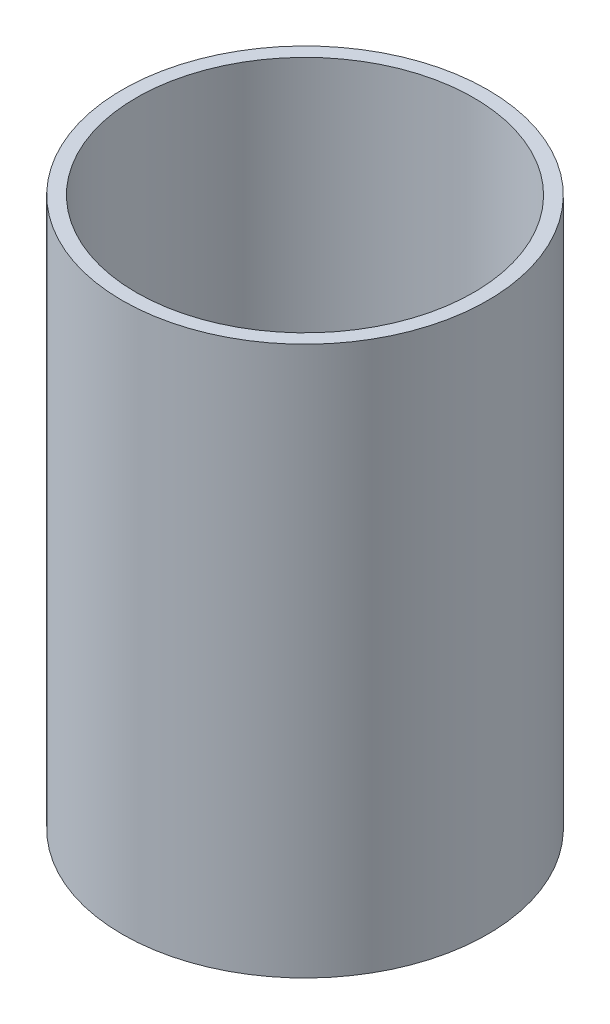
ISO-10303-21;
HEADER;
FILE_DESCRIPTION(('STEP AP214'),'2;1');
FILE_NAME('part.step','',(''),(''),'','','');
FILE_SCHEMA(('AUTOMOTIVE_DESIGN { 1 0 10303 214 1 1 1 1 }'));
ENDSEC;
DATA;
#1=APPLICATION_CONTEXT('core data for automotive mechanical design processes');
#2=APPLICATION_PROTOCOL_DEFINITION('international standard','automotive_design',2000,#1);
#3=PRODUCT_CONTEXT('',#1,'mechanical');
#4=PRODUCT('Part','Part','',(#3));
#5=PRODUCT_RELATED_PRODUCT_CATEGORY('part','',(#4));
#6=PRODUCT_DEFINITION_FORMATION('','',#4);
#7=PRODUCT_DEFINITION_CONTEXT('part definition',#1,'design');
#8=PRODUCT_DEFINITION('design','',#6,#7);
#9=PRODUCT_DEFINITION_SHAPE('','',#8);
#10=(LENGTH_UNIT() NAMED_UNIT(*) SI_UNIT(.MILLI.,.METRE.));
#11=(NAMED_UNIT(*) PLANE_ANGLE_UNIT() SI_UNIT($,.RADIAN.));
#12=(NAMED_UNIT(*) SI_UNIT($,.STERADIAN.) SOLID_ANGLE_UNIT());
#13=UNCERTAINTY_MEASURE_WITH_UNIT(LENGTH_MEASURE(1.E-05),#10,'distance_accuracy_value','');
#14=(GEOMETRIC_REPRESENTATION_CONTEXT(3) GLOBAL_UNCERTAINTY_ASSIGNED_CONTEXT((#13)) GLOBAL_UNIT_ASSIGNED_CONTEXT((#10,
#11,#12)) REPRESENTATION_CONTEXT('',''));
#15=CARTESIAN_POINT('',(0.,0.,0.));
#16=DIRECTION('',(0.,0.,1.));
#17=DIRECTION('',(1.,0.,0.));
#18=AXIS2_PLACEMENT_3D('',#15,#16,#17);
#19=CARTESIAN_POINT('',(0.,0.,0.));
#20=DIRECTION('',(0.,1.,0.));
#21=DIRECTION('',(0.,0.,1.));
#22=AXIS2_PLACEMENT_3D('',#19,#20,#21);
#23=CYLINDRICAL_SURFACE('',#22,9.525);
#24=CARTESIAN_POINT('',(0.,0.,0.));
#25=DIRECTION('',(0.,1.,0.));
#26=DIRECTION('',(0.,0.,1.));
#27=AXIS2_PLACEMENT_3D('',#24,#25,#26);
#28=CIRCLE('',#27,9.525);
#29=CARTESIAN_POINT('',(0.,0.,9.525));
#30=VERTEX_POINT('',#29);
#31=EDGE_CURVE('E10',#30,#30,#28,.T.);
#32=ORIENTED_EDGE('',*,*,#31,.F.);
#33=EDGE_LOOP('',(#32));
#34=FACE_BOUND('',#33,.T.);
#35=CARTESIAN_POINT('',(0.,30.988,0.));
#36=DIRECTION('',(0.,1.,0.));
#37=DIRECTION('',(0.,0.,1.));
#38=AXIS2_PLACEMENT_3D('',#35,#36,#37);
#39=CIRCLE('',#38,9.525);
#40=CARTESIAN_POINT('',(0.,30.988,9.525));
#41=VERTEX_POINT('',#40);
#42=EDGE_CURVE('E46',#41,#41,#39,.T.);
#43=ORIENTED_EDGE('',*,*,#42,.T.);
#44=EDGE_LOOP('',(#43));
#45=FACE_BOUND('',#44,.T.);
#46=ADVANCED_FACE('F32',(#34,#45),#23,.F.);
#47=CARTESIAN_POINT('',(9.525,0.,0.));
#48=DIRECTION('',(0.,1.,0.));
#49=DIRECTION('',(0.,0.,1.));
#50=AXIS2_PLACEMENT_3D('',#47,#48,#49);
#51=PLANE('',#50);
#52=CARTESIAN_POINT('',(0.,0.,0.));
#53=DIRECTION('',(0.,1.,0.));
#54=DIRECTION('',(0.,0.,1.));
#55=AXIS2_PLACEMENT_3D('',#52,#53,#54);
#56=CIRCLE('',#55,10.3124);
#57=CARTESIAN_POINT('',(0.,0.,10.3124));
#58=VERTEX_POINT('',#57);
#59=EDGE_CURVE('E38',#58,#58,#56,.T.);
#60=ORIENTED_EDGE('',*,*,#59,.F.);
#61=EDGE_LOOP('',(#60));
#62=FACE_BOUND('',#61,.T.);
#63=ORIENTED_EDGE('',*,*,#31,.T.);
#64=EDGE_LOOP('',(#63));
#65=FACE_BOUND('',#64,.T.);
#66=ADVANCED_FACE('F61',(#62,#65),#51,.F.);
#67=CARTESIAN_POINT('',(0.,0.,0.));
#68=DIRECTION('',(0.,1.,0.));
#69=DIRECTION('',(0.,0.,1.));
#70=AXIS2_PLACEMENT_3D('',#67,#68,#69);
#71=CYLINDRICAL_SURFACE('',#70,10.3124);
#72=CARTESIAN_POINT('',(0.,30.988,0.));
#73=DIRECTION('',(0.,1.,0.));
#74=DIRECTION('',(0.,0.,1.));
#75=AXIS2_PLACEMENT_3D('',#72,#73,#74);
#76=CIRCLE('',#75,10.3124);
#77=CARTESIAN_POINT('',(0.,30.988,10.3124));
#78=VERTEX_POINT('',#77);
#79=EDGE_CURVE('E42',#78,#78,#76,.T.);
#80=ORIENTED_EDGE('',*,*,#79,.F.);
#81=EDGE_LOOP('',(#80));
#82=FACE_BOUND('',#81,.T.);
#83=ORIENTED_EDGE('',*,*,#59,.T.);
#84=EDGE_LOOP('',(#83));
#85=FACE_BOUND('',#84,.T.);
#86=ADVANCED_FACE('F56',(#82,#85),#71,.T.);
#87=CARTESIAN_POINT('',(10.3124,30.988,0.));
#88=DIRECTION('',(0.,-1.,0.));
#89=DIRECTION('',(0.,0.,-1.));
#90=AXIS2_PLACEMENT_3D('',#87,#88,#89);
#91=PLANE('',#90);
#92=ORIENTED_EDGE('',*,*,#42,.F.);
#93=EDGE_LOOP('',(#92));
#94=FACE_BOUND('',#93,.T.);
#95=ORIENTED_EDGE('',*,*,#79,.T.);
#96=EDGE_LOOP('',(#95));
#97=FACE_BOUND('',#96,.T.);
#98=ADVANCED_FACE('F53',(#94,#97),#91,.F.);
#99=CLOSED_SHELL('',(#46,#66,#86,#98));
#100=MANIFOLD_SOLID_BREP('B2',#99);
#101=ADVANCED_BREP_SHAPE_REPRESENTATION('',(#18,#100),#14);
#102=SHAPE_DEFINITION_REPRESENTATION(#9,#101);
ENDSEC;
END-ISO-10303-21;
